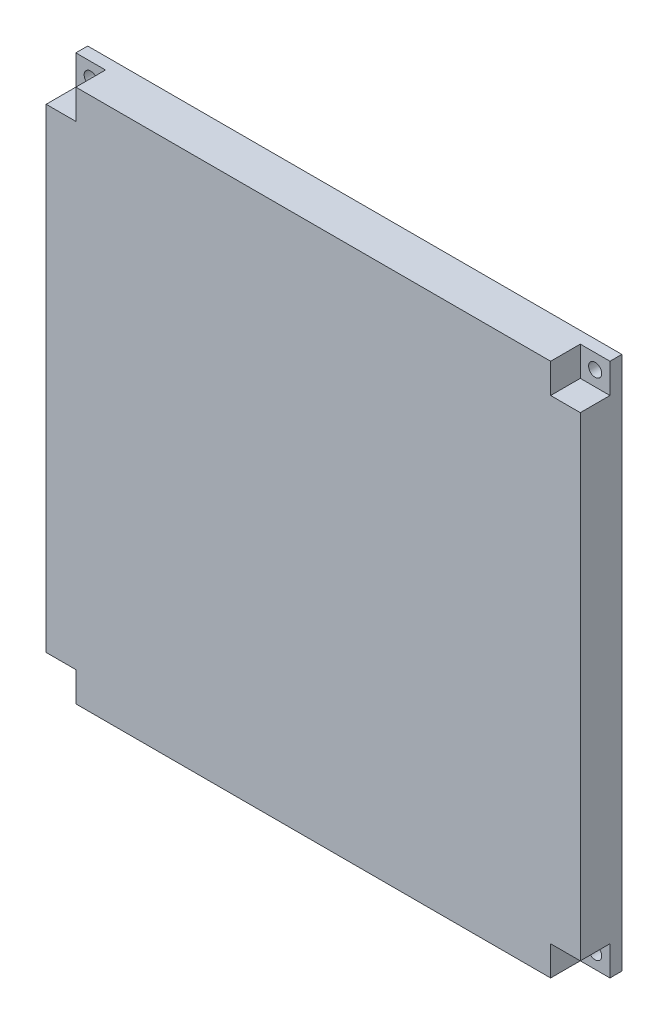
ISO-10303-21;
HEADER;
FILE_DESCRIPTION(('STEP AP214'),'2;1');
FILE_NAME('part.step','',(''),(''),'','','');
FILE_SCHEMA(('AUTOMOTIVE_DESIGN { 1 0 10303 214 1 1 1 1 }'));
ENDSEC;
DATA;
#1=APPLICATION_CONTEXT('core data for automotive mechanical design processes');
#2=APPLICATION_PROTOCOL_DEFINITION('international standard','automotive_design',2000,#1);
#3=PRODUCT_CONTEXT('',#1,'mechanical');
#4=PRODUCT('Part','Part','',(#3));
#5=PRODUCT_RELATED_PRODUCT_CATEGORY('part','',(#4));
#6=PRODUCT_DEFINITION_FORMATION('','',#4);
#7=PRODUCT_DEFINITION_CONTEXT('part definition',#1,'design');
#8=PRODUCT_DEFINITION('design','',#6,#7);
#9=PRODUCT_DEFINITION_SHAPE('','',#8);
#10=(LENGTH_UNIT() NAMED_UNIT(*) SI_UNIT(.MILLI.,.METRE.));
#11=(NAMED_UNIT(*) PLANE_ANGLE_UNIT() SI_UNIT($,.RADIAN.));
#12=(NAMED_UNIT(*) SI_UNIT($,.STERADIAN.) SOLID_ANGLE_UNIT());
#13=UNCERTAINTY_MEASURE_WITH_UNIT(LENGTH_MEASURE(1.E-05),#10,'distance_accuracy_value','');
#14=(GEOMETRIC_REPRESENTATION_CONTEXT(3) GLOBAL_UNCERTAINTY_ASSIGNED_CONTEXT((#13)) GLOBAL_UNIT_ASSIGNED_CONTEXT((#10,
#11,#12)) REPRESENTATION_CONTEXT('',''));
#15=CARTESIAN_POINT('',(0.,0.,0.));
#16=DIRECTION('',(0.,0.,1.));
#17=DIRECTION('',(1.,0.,0.));
#18=AXIS2_PLACEMENT_3D('',#15,#16,#17);
#19=CARTESIAN_POINT('',(-89.0867155495886,42.9813664596273,10.));
#20=DIRECTION('',(0.,1.,0.));
#21=DIRECTION('',(0.,0.,1.));
#22=AXIS2_PLACEMENT_3D('',#19,#20,#21);
#23=PLANE('',#22);
#24=DIRECTION('',(1.,0.,0.));
#25=VECTOR('',#24,1.);
#26=CARTESIAN_POINT('',(-84.0867155495887,42.9813664596273,3.));
#27=LINE('',#26,#25);
#28=CARTESIAN_POINT('',(-84.0867155495886,42.9813664596273,3.));
#29=VERTEX_POINT('',#28);
#30=CARTESIAN_POINT('',(5.91328445041136,42.9813664596273,3.));
#31=VERTEX_POINT('',#30);
#32=EDGE_CURVE('E178',#29,#31,#27,.T.);
#33=ORIENTED_EDGE('',*,*,#32,.F.);
#34=DIRECTION('',(0.,0.,-1.));
#35=VECTOR('',#34,1.);
#36=CARTESIAN_POINT('',(-84.0867155495886,42.9813664596273,3.));
#37=LINE('',#36,#35);
#38=CARTESIAN_POINT('',(-84.0867155495886,42.9813664596273,5.));
#39=VERTEX_POINT('',#38);
#40=EDGE_CURVE('E58',#39,#29,#37,.T.);
#41=ORIENTED_EDGE('',*,*,#40,.F.);
#42=DIRECTION('',(-1.,0.,0.));
#43=VECTOR('',#42,1.);
#44=CARTESIAN_POINT('',(-84.0867155495886,42.9813664596273,5.));
#45=LINE('',#44,#43);
#46=CARTESIAN_POINT('',(-79.0867155495886,42.9813664596273,5.));
#47=VERTEX_POINT('',#46);
#48=EDGE_CURVE('E298',#47,#39,#45,.T.);
#49=ORIENTED_EDGE('',*,*,#48,.F.);
#50=DIRECTION('',(0.,0.,1.));
#51=VECTOR('',#50,1.);
#52=CARTESIAN_POINT('',(-79.0867155495886,42.9813664596273,5.));
#53=LINE('',#52,#51);
#54=CARTESIAN_POINT('',(-79.0867155495886,42.9813664596273,10.));
#55=VERTEX_POINT('',#54);
#56=EDGE_CURVE('E308',#47,#55,#53,.T.);
#57=ORIENTED_EDGE('',*,*,#56,.T.);
#58=DIRECTION('',(1.,0.,0.));
#59=VECTOR('',#58,1.);
#60=CARTESIAN_POINT('',(-89.0867155495886,42.9813664596273,10.));
#61=LINE('',#60,#59);
#62=CARTESIAN_POINT('',(0.913284450411361,42.9813664596273,10.));
#63=VERTEX_POINT('',#62);
#64=EDGE_CURVE('E50',#55,#63,#61,.T.);
#65=ORIENTED_EDGE('',*,*,#64,.T.);
#66=DIRECTION('',(0.,0.,1.));
#67=VECTOR('',#66,1.);
#68=CARTESIAN_POINT('',(0.913284450411361,42.9813664596273,5.));
#69=LINE('',#68,#67);
#70=CARTESIAN_POINT('',(0.913284450411361,42.9813664596273,5.));
#71=VERTEX_POINT('',#70);
#72=EDGE_CURVE('E239',#71,#63,#69,.T.);
#73=ORIENTED_EDGE('',*,*,#72,.F.);
#74=DIRECTION('',(-1.,0.,0.));
#75=VECTOR('',#74,1.);
#76=CARTESIAN_POINT('',(5.91328445041135,42.9813664596273,5.));
#77=LINE('',#76,#75);
#78=CARTESIAN_POINT('',(5.91328445041136,42.9813664596273,5.));
#79=VERTEX_POINT('',#78);
#80=EDGE_CURVE('E226',#79,#71,#77,.T.);
#81=ORIENTED_EDGE('',*,*,#80,.F.);
#82=DIRECTION('',(0.,0.,1.));
#83=VECTOR('',#82,1.);
#84=CARTESIAN_POINT('',(5.91328445041136,42.9813664596273,3.));
#85=LINE('',#84,#83);
#86=EDGE_CURVE('E353',#31,#79,#85,.T.);
#87=ORIENTED_EDGE('',*,*,#86,.F.);
#88=EDGE_LOOP('',(#33,#41,#49,#57,#65,#73,#81,#87));
#89=FACE_BOUND('',#88,.T.);
#90=ADVANCED_FACE('F41',(#89),#23,.T.);
#91=CARTESIAN_POINT('',(-89.0867155495886,-47.0186335403727,10.));
#92=DIRECTION('',(0.,1.,0.));
#93=DIRECTION('',(0.,0.,1.));
#94=AXIS2_PLACEMENT_3D('',#91,#92,#93);
#95=PLANE('',#94);
#96=DIRECTION('',(0.,0.,1.));
#97=VECTOR('',#96,1.);
#98=CARTESIAN_POINT('',(-84.0867155495886,-47.0186335403727,3.00000000000001));
#99=LINE('',#98,#97);
#100=CARTESIAN_POINT('',(-84.0867155495886,-47.0186335403727,3.00000000000001));
#101=VERTEX_POINT('',#100);
#102=CARTESIAN_POINT('',(-84.0867155495886,-47.0186335403727,5.));
#103=VERTEX_POINT('',#102);
#104=EDGE_CURVE('E157',#101,#103,#99,.T.);
#105=ORIENTED_EDGE('',*,*,#104,.F.);
#106=DIRECTION('',(-1.,0.,0.));
#107=VECTOR('',#106,1.);
#108=CARTESIAN_POINT('',(5.91328445041138,-47.0186335403727,3.));
#109=LINE('',#108,#107);
#110=CARTESIAN_POINT('',(5.91328445041136,-47.0186335403727,3.));
#111=VERTEX_POINT('',#110);
#112=EDGE_CURVE('E168',#111,#101,#109,.T.);
#113=ORIENTED_EDGE('',*,*,#112,.F.);
#114=DIRECTION('',(0.,0.,-1.));
#115=VECTOR('',#114,1.);
#116=CARTESIAN_POINT('',(5.91328445041137,-47.0186335403727,2.99999999999999));
#117=LINE('',#116,#115);
#118=CARTESIAN_POINT('',(5.91328445041137,-47.0186335403727,5.));
#119=VERTEX_POINT('',#118);
#120=EDGE_CURVE('E66',#119,#111,#117,.T.);
#121=ORIENTED_EDGE('',*,*,#120,.F.);
#122=DIRECTION('',(1.,0.,0.));
#123=VECTOR('',#122,1.);
#124=CARTESIAN_POINT('',(5.91328445041132,-47.0186335403727,5.));
#125=LINE('',#124,#123);
#126=CARTESIAN_POINT('',(0.913284450411334,-47.0186335403727,5.));
#127=VERTEX_POINT('',#126);
#128=EDGE_CURVE('E188',#127,#119,#125,.T.);
#129=ORIENTED_EDGE('',*,*,#128,.F.);
#130=DIRECTION('',(0.,0.,1.));
#131=VECTOR('',#130,1.);
#132=CARTESIAN_POINT('',(0.913284450411334,-47.0186335403727,5.));
#133=LINE('',#132,#131);
#134=CARTESIAN_POINT('',(0.913284450411334,-47.0186335403727,10.));
#135=VERTEX_POINT('',#134);
#136=EDGE_CURVE('E211',#127,#135,#133,.T.);
#137=ORIENTED_EDGE('',*,*,#136,.T.);
#138=DIRECTION('',(1.,0.,0.));
#139=VECTOR('',#138,1.);
#140=CARTESIAN_POINT('',(-89.0867155495886,-47.0186335403727,10.));
#141=LINE('',#140,#139);
#142=CARTESIAN_POINT('',(-79.0867155495886,-47.0186335403727,10.));
#143=VERTEX_POINT('',#142);
#144=EDGE_CURVE('E11',#143,#135,#141,.T.);
#145=ORIENTED_EDGE('',*,*,#144,.F.);
#146=DIRECTION('',(0.,0.,1.));
#147=VECTOR('',#146,1.);
#148=CARTESIAN_POINT('',(-79.0867155495886,-47.0186335403727,5.));
#149=LINE('',#148,#147);
#150=CARTESIAN_POINT('',(-79.0867155495886,-47.0186335403727,5.));
#151=VERTEX_POINT('',#150);
#152=EDGE_CURVE('E271',#151,#143,#149,.T.);
#153=ORIENTED_EDGE('',*,*,#152,.F.);
#154=DIRECTION('',(1.,0.,0.));
#155=VECTOR('',#154,1.);
#156=CARTESIAN_POINT('',(-84.0867155495886,-47.0186335403727,5.));
#157=LINE('',#156,#155);
#158=EDGE_CURVE('E171',#103,#151,#157,.T.);
#159=ORIENTED_EDGE('',*,*,#158,.F.);
#160=EDGE_LOOP('',(#105,#113,#121,#129,#137,#145,#153,#159));
#161=FACE_BOUND('',#160,.T.);
#162=ADVANCED_FACE('F167',(#161),#95,.F.);
#163=CARTESIAN_POINT('',(0.,0.,10.));
#164=DIRECTION('',(0.,0.,-1.));
#165=DIRECTION('',(-1.,0.,0.));
#166=AXIS2_PLACEMENT_3D('',#163,#164,#165);
#167=PLANE('',#166);
#168=DIRECTION('',(0.,1.,0.));
#169=VECTOR('',#168,1.);
#170=CARTESIAN_POINT('',(-84.0867155495886,42.9813664596273,10.));
#171=LINE('',#170,#169);
#172=CARTESIAN_POINT('',(-84.0867155495886,-42.0186335403727,10.));
#173=VERTEX_POINT('',#172);
#174=CARTESIAN_POINT('',(-84.0867155495886,37.9813664596273,10.));
#175=VERTEX_POINT('',#174);
#176=EDGE_CURVE('E173',#173,#175,#171,.T.);
#177=ORIENTED_EDGE('',*,*,#176,.F.);
#178=DIRECTION('',(-1.,0.,0.));
#179=VECTOR('',#178,1.);
#180=CARTESIAN_POINT('',(-84.0867155495886,-42.0186335403727,10.));
#181=LINE('',#180,#179);
#182=CARTESIAN_POINT('',(-79.0867155495886,-42.0186335403727,10.));
#183=VERTEX_POINT('',#182);
#184=EDGE_CURVE('E260',#183,#173,#181,.T.);
#185=ORIENTED_EDGE('',*,*,#184,.F.);
#186=DIRECTION('',(0.,1.,0.));
#187=VECTOR('',#186,1.);
#188=CARTESIAN_POINT('',(-79.0867155495886,-47.0186335403727,10.));
#189=LINE('',#188,#187);
#190=EDGE_CURVE('E215',#143,#183,#189,.T.);
#191=ORIENTED_EDGE('',*,*,#190,.F.);
#192=ORIENTED_EDGE('',*,*,#144,.T.);
#193=DIRECTION('',(0.,-1.,0.));
#194=VECTOR('',#193,1.);
#195=CARTESIAN_POINT('',(0.913284450411334,-47.0186335403727,10.));
#196=LINE('',#195,#194);
#197=CARTESIAN_POINT('',(0.913284450411334,-42.0186335403727,10.));
#198=VERTEX_POINT('',#197);
#199=EDGE_CURVE('E193',#198,#135,#196,.T.);
#200=ORIENTED_EDGE('',*,*,#199,.F.);
#201=DIRECTION('',(-1.,0.,0.));
#202=VECTOR('',#201,1.);
#203=CARTESIAN_POINT('',(5.91328445041132,-42.0186335403727,10.));
#204=LINE('',#203,#202);
#205=CARTESIAN_POINT('',(5.91328445041137,-42.0186335403726,10.));
#206=VERTEX_POINT('',#205);
#207=EDGE_CURVE('E183',#206,#198,#204,.T.);
#208=ORIENTED_EDGE('',*,*,#207,.F.);
#209=DIRECTION('',(0.,-1.,0.));
#210=VECTOR('',#209,1.);
#211=CARTESIAN_POINT('',(5.91328445041136,42.9813664596273,10.));
#212=LINE('',#211,#210);
#213=CARTESIAN_POINT('',(5.91328445041136,37.9813664596273,10.));
#214=VERTEX_POINT('',#213);
#215=EDGE_CURVE('E350',#214,#206,#212,.T.);
#216=ORIENTED_EDGE('',*,*,#215,.F.);
#217=DIRECTION('',(1.,0.,0.));
#218=VECTOR('',#217,1.);
#219=CARTESIAN_POINT('',(5.91328445041135,37.9813664596273,10.));
#220=LINE('',#219,#218);
#221=CARTESIAN_POINT('',(0.913284450411361,37.9813664596273,10.));
#222=VERTEX_POINT('',#221);
#223=EDGE_CURVE('E227',#222,#214,#220,.T.);
#224=ORIENTED_EDGE('',*,*,#223,.F.);
#225=DIRECTION('',(0.,-1.,0.));
#226=VECTOR('',#225,1.);
#227=CARTESIAN_POINT('',(0.913284450411361,42.9813664596273,10.));
#228=LINE('',#227,#226);
#229=EDGE_CURVE('E240',#63,#222,#228,.T.);
#230=ORIENTED_EDGE('',*,*,#229,.F.);
#231=ORIENTED_EDGE('',*,*,#64,.F.);
#232=DIRECTION('',(0.,1.,0.));
#233=VECTOR('',#232,1.);
#234=CARTESIAN_POINT('',(-79.0867155495886,42.9813664596273,10.));
#235=LINE('',#234,#233);
#236=CARTESIAN_POINT('',(-79.0867155495886,37.9813664596273,10.));
#237=VERTEX_POINT('',#236);
#238=EDGE_CURVE('E290',#237,#55,#235,.T.);
#239=ORIENTED_EDGE('',*,*,#238,.F.);
#240=DIRECTION('',(1.,0.,0.));
#241=VECTOR('',#240,1.);
#242=CARTESIAN_POINT('',(-84.0867155495886,37.9813664596273,10.));
#243=LINE('',#242,#241);
#244=EDGE_CURVE('E251',#175,#237,#243,.T.);
#245=ORIENTED_EDGE('',*,*,#244,.F.);
#246=EDGE_LOOP('',(#177,#185,#191,#192,#200,#208,#216,#224,#230,#231,#239,#245));
#247=FACE_BOUND('',#246,.T.);
#248=ADVANCED_FACE('F370',(#247),#167,.F.);
#249=CARTESIAN_POINT('',(0.,0.,3.));
#250=DIRECTION('',(0.,0.,1.));
#251=DIRECTION('',(1.,0.,0.));
#252=AXIS2_PLACEMENT_3D('',#249,#250,#251);
#253=PLANE('',#252);
#254=CARTESIAN_POINT('',(3.41328445041138,40.4813664596273,3.));
#255=DIRECTION('',(0.,0.,-1.));
#256=DIRECTION('',(-1.,0.,0.));
#257=AXIS2_PLACEMENT_3D('',#254,#255,#256);
#258=CIRCLE('',#257,1.1);
#259=CARTESIAN_POINT('',(2.31328445041138,40.4813664596273,3.));
#260=VERTEX_POINT('',#259);
#261=EDGE_CURVE('E44',#260,#260,#258,.T.);
#262=ORIENTED_EDGE('',*,*,#261,.F.);
#263=EDGE_LOOP('',(#262));
#264=FACE_BOUND('',#263,.T.);
#265=CARTESIAN_POINT('',(-81.5867155495887,40.4813664596273,3.));
#266=DIRECTION('',(0.,0.,1.));
#267=DIRECTION('',(1.,0.,0.));
#268=AXIS2_PLACEMENT_3D('',#265,#266,#267);
#269=CIRCLE('',#268,1.1);
#270=CARTESIAN_POINT('',(-80.4867155495887,40.4813664596273,3.));
#271=VERTEX_POINT('',#270);
#272=EDGE_CURVE('E330',#271,#271,#269,.T.);
#273=ORIENTED_EDGE('',*,*,#272,.T.);
#274=EDGE_LOOP('',(#273));
#275=FACE_BOUND('',#274,.T.);
#276=CARTESIAN_POINT('',(-81.5867155495886,-44.5186335403727,3.));
#277=DIRECTION('',(0.,0.,1.));
#278=DIRECTION('',(1.,0.,0.));
#279=AXIS2_PLACEMENT_3D('',#276,#277,#278);
#280=CIRCLE('',#279,1.10000000000001);
#281=CARTESIAN_POINT('',(-80.4867155495886,-44.5186335403727,3.));
#282=VERTEX_POINT('',#281);
#283=EDGE_CURVE('E326',#282,#282,#280,.T.);
#284=ORIENTED_EDGE('',*,*,#283,.T.);
#285=EDGE_LOOP('',(#284));
#286=FACE_BOUND('',#285,.T.);
#287=CARTESIAN_POINT('',(3.41328445041138,-44.5186335403727,3.));
#288=DIRECTION('',(0.,0.,1.));
#289=DIRECTION('',(1.,0.,0.));
#290=AXIS2_PLACEMENT_3D('',#287,#288,#289);
#291=CIRCLE('',#290,1.1);
#292=CARTESIAN_POINT('',(4.51328445041138,-44.5186335403727,3.));
#293=VERTEX_POINT('',#292);
#294=EDGE_CURVE('E321',#293,#293,#291,.T.);
#295=ORIENTED_EDGE('',*,*,#294,.T.);
#296=EDGE_LOOP('',(#295));
#297=FACE_BOUND('',#296,.T.);
#298=DIRECTION('',(0.,-1.,0.));
#299=VECTOR('',#298,1.);
#300=CARTESIAN_POINT('',(-84.0867155495886,42.9813664596273,3.));
#301=LINE('',#300,#299);
#302=EDGE_CURVE('E154',#29,#101,#301,.T.);
#303=ORIENTED_EDGE('',*,*,#302,.F.);
#304=ORIENTED_EDGE('',*,*,#32,.T.);
#305=DIRECTION('',(0.,1.,0.));
#306=VECTOR('',#305,1.);
#307=CARTESIAN_POINT('',(5.91328445041136,42.9813664596273,3.));
#308=LINE('',#307,#306);
#309=EDGE_CURVE('E176',#111,#31,#308,.T.);
#310=ORIENTED_EDGE('',*,*,#309,.F.);
#311=ORIENTED_EDGE('',*,*,#112,.T.);
#312=EDGE_LOOP('',(#303,#304,#310,#311));
#313=FACE_BOUND('',#312,.T.);
#314=ADVANCED_FACE('F175',(#264,#275,#286,#297,#313),#253,.F.);
#315=CARTESIAN_POINT('',(-79.0867155495886,42.9813664596273,5.));
#316=DIRECTION('',(1.,0.,0.));
#317=DIRECTION('',(0.,0.,-1.));
#318=AXIS2_PLACEMENT_3D('',#315,#316,#317);
#319=PLANE('',#318);
#320=ORIENTED_EDGE('',*,*,#238,.T.);
#321=ORIENTED_EDGE('',*,*,#56,.F.);
#322=DIRECTION('',(0.,1.,0.));
#323=VECTOR('',#322,1.);
#324=CARTESIAN_POINT('',(-79.0867155495886,42.9813664596273,5.));
#325=LINE('',#324,#323);
#326=CARTESIAN_POINT('',(-79.0867155495886,37.9813664596273,5.));
#327=VERTEX_POINT('',#326);
#328=EDGE_CURVE('E294',#327,#47,#325,.T.);
#329=ORIENTED_EDGE('',*,*,#328,.F.);
#330=DIRECTION('',(0.,0.,1.));
#331=VECTOR('',#330,1.);
#332=CARTESIAN_POINT('',(-79.0867155495886,37.9813664596273,5.));
#333=LINE('',#332,#331);
#334=EDGE_CURVE('E312',#327,#237,#333,.T.);
#335=ORIENTED_EDGE('',*,*,#334,.T.);
#336=EDGE_LOOP('',(#320,#321,#329,#335));
#337=FACE_BOUND('',#336,.T.);
#338=ADVANCED_FACE('F374',(#337),#319,.F.);
#339=CARTESIAN_POINT('',(-84.0867155495886,37.9813664596273,5.));
#340=DIRECTION('',(0.,-1.,0.));
#341=DIRECTION('',(0.,0.,-1.));
#342=AXIS2_PLACEMENT_3D('',#339,#340,#341);
#343=PLANE('',#342);
#344=ORIENTED_EDGE('',*,*,#244,.T.);
#345=ORIENTED_EDGE('',*,*,#334,.F.);
#346=DIRECTION('',(1.,0.,0.));
#347=VECTOR('',#346,1.);
#348=CARTESIAN_POINT('',(-84.0867155495886,37.9813664596273,5.));
#349=LINE('',#348,#347);
#350=CARTESIAN_POINT('',(-84.0867155495886,37.9813664596273,5.));
#351=VERTEX_POINT('',#350);
#352=EDGE_CURVE('E289',#351,#327,#349,.T.);
#353=ORIENTED_EDGE('',*,*,#352,.F.);
#354=DIRECTION('',(0.,0.,1.));
#355=VECTOR('',#354,1.);
#356=CARTESIAN_POINT('',(-84.0867155495886,37.9813664596273,5.));
#357=LINE('',#356,#355);
#358=EDGE_CURVE('E302',#351,#175,#357,.T.);
#359=ORIENTED_EDGE('',*,*,#358,.T.);
#360=EDGE_LOOP('',(#344,#345,#353,#359));
#361=FACE_BOUND('',#360,.T.);
#362=ADVANCED_FACE('F368',(#361),#343,.F.);
#363=CARTESIAN_POINT('',(0.,0.,5.));
#364=DIRECTION('',(0.,0.,1.));
#365=DIRECTION('',(1.,0.,0.));
#366=AXIS2_PLACEMENT_3D('',#363,#364,#365);
#367=PLANE('',#366);
#368=CARTESIAN_POINT('',(-81.5867155495887,40.4813664596273,5.));
#369=DIRECTION('',(0.,0.,1.));
#370=DIRECTION('',(1.,0.,0.));
#371=AXIS2_PLACEMENT_3D('',#368,#369,#370);
#372=CIRCLE('',#371,1.1);
#373=CARTESIAN_POINT('',(-80.4867155495887,40.4813664596273,5.));
#374=VERTEX_POINT('',#373);
#375=EDGE_CURVE('E333',#374,#374,#372,.T.);
#376=ORIENTED_EDGE('',*,*,#375,.F.);
#377=EDGE_LOOP('',(#376));
#378=FACE_BOUND('',#377,.T.);
#379=DIRECTION('',(0.,-1.,0.));
#380=VECTOR('',#379,1.);
#381=CARTESIAN_POINT('',(-84.0867155495886,42.9813664596273,5.));
#382=LINE('',#381,#380);
#383=EDGE_CURVE('E285',#39,#351,#382,.T.);
#384=ORIENTED_EDGE('',*,*,#383,.T.);
#385=ORIENTED_EDGE('',*,*,#352,.T.);
#386=ORIENTED_EDGE('',*,*,#328,.T.);
#387=ORIENTED_EDGE('',*,*,#48,.T.);
#388=EDGE_LOOP('',(#384,#385,#386,#387));
#389=FACE_BOUND('',#388,.T.);
#390=ADVANCED_FACE('F380',(#378,#389),#367,.T.);
#391=CARTESIAN_POINT('',(0.913284450411334,-47.0186335403727,5.));
#392=DIRECTION('',(-1.,0.,0.));
#393=DIRECTION('',(0.,0.,1.));
#394=AXIS2_PLACEMENT_3D('',#391,#392,#393);
#395=PLANE('',#394);
#396=ORIENTED_EDGE('',*,*,#199,.T.);
#397=ORIENTED_EDGE('',*,*,#136,.F.);
#398=DIRECTION('',(0.,-1.,0.));
#399=VECTOR('',#398,1.);
#400=CARTESIAN_POINT('',(0.913284450411334,-47.0186335403727,5.));
#401=LINE('',#400,#399);
#402=CARTESIAN_POINT('',(0.913284450411334,-42.0186335403727,5.));
#403=VERTEX_POINT('',#402);
#404=EDGE_CURVE('E201',#403,#127,#401,.T.);
#405=ORIENTED_EDGE('',*,*,#404,.F.);
#406=DIRECTION('',(0.,0.,1.));
#407=VECTOR('',#406,1.);
#408=CARTESIAN_POINT('',(0.913284450411334,-42.0186335403727,5.));
#409=LINE('',#408,#407);
#410=EDGE_CURVE('E216',#403,#198,#409,.T.);
#411=ORIENTED_EDGE('',*,*,#410,.T.);
#412=EDGE_LOOP('',(#396,#397,#405,#411));
#413=FACE_BOUND('',#412,.T.);
#414=ADVANCED_FACE('F382',(#413),#395,.F.);
#415=CARTESIAN_POINT('',(5.91328445041132,-42.0186335403727,5.));
#416=DIRECTION('',(0.,1.,0.));
#417=DIRECTION('',(-1.,0.,0.));
#418=AXIS2_PLACEMENT_3D('',#415,#416,#417);
#419=PLANE('',#418);
#420=ORIENTED_EDGE('',*,*,#207,.T.);
#421=ORIENTED_EDGE('',*,*,#410,.F.);
#422=DIRECTION('',(-1.,0.,0.));
#423=VECTOR('',#422,1.);
#424=CARTESIAN_POINT('',(5.91328445041132,-42.0186335403727,5.));
#425=LINE('',#424,#423);
#426=CARTESIAN_POINT('',(5.91328445041137,-42.0186335403727,5.));
#427=VERTEX_POINT('',#426);
#428=EDGE_CURVE('E197',#427,#403,#425,.T.);
#429=ORIENTED_EDGE('',*,*,#428,.F.);
#430=DIRECTION('',(0.,0.,1.));
#431=VECTOR('',#430,1.);
#432=CARTESIAN_POINT('',(5.91328445041132,-42.0186335403727,5.));
#433=LINE('',#432,#431);
#434=EDGE_CURVE('E205',#427,#206,#433,.T.);
#435=ORIENTED_EDGE('',*,*,#434,.T.);
#436=EDGE_LOOP('',(#420,#421,#429,#435));
#437=FACE_BOUND('',#436,.T.);
#438=ADVANCED_FACE('F389',(#437),#419,.F.);
#439=CARTESIAN_POINT('',(0.,0.,5.));
#440=DIRECTION('',(0.,0.,-1.));
#441=DIRECTION('',(-1.,0.,0.));
#442=AXIS2_PLACEMENT_3D('',#439,#440,#441);
#443=PLANE('',#442);
#444=CARTESIAN_POINT('',(3.41328445041138,-44.5186335403727,5.));
#445=DIRECTION('',(0.,0.,-1.));
#446=DIRECTION('',(-1.,0.,0.));
#447=AXIS2_PLACEMENT_3D('',#444,#445,#446);
#448=CIRCLE('',#447,1.1);
#449=CARTESIAN_POINT('',(2.31328445041137,-44.5186335403727,5.));
#450=VERTEX_POINT('',#449);
#451=EDGE_CURVE('E325',#450,#450,#448,.T.);
#452=ORIENTED_EDGE('',*,*,#451,.T.);
#453=EDGE_LOOP('',(#452));
#454=FACE_BOUND('',#453,.T.);
#455=ORIENTED_EDGE('',*,*,#128,.T.);
#456=DIRECTION('',(0.,1.,0.));
#457=VECTOR('',#456,1.);
#458=CARTESIAN_POINT('',(5.91328445041132,-47.0186335403727,5.));
#459=LINE('',#458,#457);
#460=EDGE_CURVE('E192',#119,#427,#459,.T.);
#461=ORIENTED_EDGE('',*,*,#460,.T.);
#462=ORIENTED_EDGE('',*,*,#428,.T.);
#463=ORIENTED_EDGE('',*,*,#404,.T.);
#464=EDGE_LOOP('',(#455,#461,#462,#463));
#465=FACE_BOUND('',#464,.T.);
#466=ADVANCED_FACE('F417',(#454,#465),#443,.F.);
#467=CARTESIAN_POINT('',(-84.0867155495886,-42.0186335403727,5.));
#468=DIRECTION('',(0.,1.,0.));
#469=DIRECTION('',(-1.,0.,0.));
#470=AXIS2_PLACEMENT_3D('',#467,#468,#469);
#471=PLANE('',#470);
#472=ORIENTED_EDGE('',*,*,#184,.T.);
#473=DIRECTION('',(0.,0.,1.));
#474=VECTOR('',#473,1.);
#475=CARTESIAN_POINT('',(-84.0867155495886,-42.0186335403727,5.));
#476=LINE('',#475,#474);
#477=CARTESIAN_POINT('',(-84.0867155495886,-42.0186335403727,5.));
#478=VERTEX_POINT('',#477);
#479=EDGE_CURVE('E244',#478,#173,#476,.T.);
#480=ORIENTED_EDGE('',*,*,#479,.F.);
#481=DIRECTION('',(-1.,0.,0.));
#482=VECTOR('',#481,1.);
#483=CARTESIAN_POINT('',(-84.0867155495886,-42.0186335403727,5.));
#484=LINE('',#483,#482);
#485=CARTESIAN_POINT('',(-79.0867155495886,-42.0186335403727,5.));
#486=VERTEX_POINT('',#485);
#487=EDGE_CURVE('E267',#486,#478,#484,.T.);
#488=ORIENTED_EDGE('',*,*,#487,.F.);
#489=DIRECTION('',(0.,0.,1.));
#490=VECTOR('',#489,1.);
#491=CARTESIAN_POINT('',(-79.0867155495886,-42.0186335403727,5.));
#492=LINE('',#491,#490);
#493=EDGE_CURVE('E280',#486,#183,#492,.T.);
#494=ORIENTED_EDGE('',*,*,#493,.T.);
#495=EDGE_LOOP('',(#472,#480,#488,#494));
#496=FACE_BOUND('',#495,.T.);
#497=ADVANCED_FACE('F419',(#496),#471,.F.);
#498=CARTESIAN_POINT('',(-79.0867155495886,-47.0186335403727,5.));
#499=DIRECTION('',(1.,0.,0.));
#500=DIRECTION('',(0.,0.,-1.));
#501=AXIS2_PLACEMENT_3D('',#498,#499,#500);
#502=PLANE('',#501);
#503=ORIENTED_EDGE('',*,*,#190,.T.);
#504=ORIENTED_EDGE('',*,*,#493,.F.);
#505=DIRECTION('',(0.,1.,0.));
#506=VECTOR('',#505,1.);
#507=CARTESIAN_POINT('',(-79.0867155495886,-47.0186335403727,5.));
#508=LINE('',#507,#506);
#509=EDGE_CURVE('E263',#151,#486,#508,.T.);
#510=ORIENTED_EDGE('',*,*,#509,.F.);
#511=ORIENTED_EDGE('',*,*,#152,.T.);
#512=EDGE_LOOP('',(#503,#504,#510,#511));
#513=FACE_BOUND('',#512,.T.);
#514=ADVANCED_FACE('F441',(#513),#502,.F.);
#515=CARTESIAN_POINT('',(0.,0.,5.));
#516=DIRECTION('',(0.,0.,-1.));
#517=DIRECTION('',(-1.,0.,0.));
#518=AXIS2_PLACEMENT_3D('',#515,#516,#517);
#519=PLANE('',#518);
#520=CARTESIAN_POINT('',(-81.5867155495886,-44.5186335403727,5.));
#521=DIRECTION('',(0.,0.,-1.));
#522=DIRECTION('',(-1.,0.,0.));
#523=AXIS2_PLACEMENT_3D('',#520,#521,#522);
#524=CIRCLE('',#523,1.10000000000001);
#525=CARTESIAN_POINT('',(-82.6867155495886,-44.5186335403727,5.));
#526=VERTEX_POINT('',#525);
#527=EDGE_CURVE('E329',#526,#526,#524,.T.);
#528=ORIENTED_EDGE('',*,*,#527,.T.);
#529=EDGE_LOOP('',(#528));
#530=FACE_BOUND('',#529,.T.);
#531=DIRECTION('',(0.,-1.,0.));
#532=VECTOR('',#531,1.);
#533=CARTESIAN_POINT('',(-84.0867155495886,-47.0186335403727,5.));
#534=LINE('',#533,#532);
#535=EDGE_CURVE('E257',#478,#103,#534,.T.);
#536=ORIENTED_EDGE('',*,*,#535,.T.);
#537=ORIENTED_EDGE('',*,*,#158,.T.);
#538=ORIENTED_EDGE('',*,*,#509,.T.);
#539=ORIENTED_EDGE('',*,*,#487,.T.);
#540=EDGE_LOOP('',(#536,#537,#538,#539));
#541=FACE_BOUND('',#540,.T.);
#542=ADVANCED_FACE('F434',(#530,#541),#519,.F.);
#543=CARTESIAN_POINT('',(5.91328445041135,37.9813664596273,5.));
#544=DIRECTION('',(0.,-1.,0.));
#545=DIRECTION('',(1.,0.,0.));
#546=AXIS2_PLACEMENT_3D('',#543,#544,#545);
#547=PLANE('',#546);
#548=ORIENTED_EDGE('',*,*,#223,.T.);
#549=DIRECTION('',(0.,0.,1.));
#550=VECTOR('',#549,1.);
#551=CARTESIAN_POINT('',(5.91328445041135,37.9813664596273,5.));
#552=LINE('',#551,#550);
#553=CARTESIAN_POINT('',(5.91328445041136,37.9813664596273,5.));
#554=VERTEX_POINT('',#553);
#555=EDGE_CURVE('E248',#554,#214,#552,.T.);
#556=ORIENTED_EDGE('',*,*,#555,.F.);
#557=DIRECTION('',(1.,0.,0.));
#558=VECTOR('',#557,1.);
#559=CARTESIAN_POINT('',(5.91328445041135,37.9813664596273,5.));
#560=LINE('',#559,#558);
#561=CARTESIAN_POINT('',(0.913284450411361,37.9813664596273,5.));
#562=VERTEX_POINT('',#561);
#563=EDGE_CURVE('E235',#562,#554,#560,.T.);
#564=ORIENTED_EDGE('',*,*,#563,.F.);
#565=DIRECTION('',(0.,0.,1.));
#566=VECTOR('',#565,1.);
#567=CARTESIAN_POINT('',(0.913284450411361,37.9813664596273,5.));
#568=LINE('',#567,#566);
#569=EDGE_CURVE('E252',#562,#222,#568,.T.);
#570=ORIENTED_EDGE('',*,*,#569,.T.);
#571=EDGE_LOOP('',(#548,#556,#564,#570));
#572=FACE_BOUND('',#571,.T.);
#573=ADVANCED_FACE('F431',(#572),#547,.F.);
#574=CARTESIAN_POINT('',(0.913284450411361,42.9813664596273,5.));
#575=DIRECTION('',(-1.,0.,0.));
#576=DIRECTION('',(0.,0.,1.));
#577=AXIS2_PLACEMENT_3D('',#574,#575,#576);
#578=PLANE('',#577);
#579=ORIENTED_EDGE('',*,*,#229,.T.);
#580=ORIENTED_EDGE('',*,*,#569,.F.);
#581=DIRECTION('',(0.,-1.,0.));
#582=VECTOR('',#581,1.);
#583=CARTESIAN_POINT('',(0.913284450411361,42.9813664596273,5.));
#584=LINE('',#583,#582);
#585=EDGE_CURVE('E231',#71,#562,#584,.T.);
#586=ORIENTED_EDGE('',*,*,#585,.F.);
#587=ORIENTED_EDGE('',*,*,#72,.T.);
#588=EDGE_LOOP('',(#579,#580,#586,#587));
#589=FACE_BOUND('',#588,.T.);
#590=ADVANCED_FACE('F429',(#589),#578,.F.);
#591=CARTESIAN_POINT('',(0.,0.,5.));
#592=DIRECTION('',(0.,0.,-1.));
#593=DIRECTION('',(-1.,0.,0.));
#594=AXIS2_PLACEMENT_3D('',#591,#592,#593);
#595=PLANE('',#594);
#596=CARTESIAN_POINT('',(3.41328445041138,40.4813664596273,5.));
#597=DIRECTION('',(0.,0.,-1.));
#598=DIRECTION('',(-1.,0.,0.));
#599=AXIS2_PLACEMENT_3D('',#596,#597,#598);
#600=CIRCLE('',#599,1.1);
#601=CARTESIAN_POINT('',(2.31328445041138,40.4813664596273,5.));
#602=VERTEX_POINT('',#601);
#603=EDGE_CURVE('E179',#602,#602,#600,.T.);
#604=ORIENTED_EDGE('',*,*,#603,.T.);
#605=EDGE_LOOP('',(#604));
#606=FACE_BOUND('',#605,.T.);
#607=DIRECTION('',(0.,1.,0.));
#608=VECTOR('',#607,1.);
#609=CARTESIAN_POINT('',(5.91328445041135,42.9813664596273,5.));
#610=LINE('',#609,#608);
#611=EDGE_CURVE('E222',#554,#79,#610,.T.);
#612=ORIENTED_EDGE('',*,*,#611,.T.);
#613=ORIENTED_EDGE('',*,*,#80,.T.);
#614=ORIENTED_EDGE('',*,*,#585,.T.);
#615=ORIENTED_EDGE('',*,*,#563,.T.);
#616=EDGE_LOOP('',(#612,#613,#614,#615));
#617=FACE_BOUND('',#616,.T.);
#618=ADVANCED_FACE('F425',(#606,#617),#595,.F.);
#619=CARTESIAN_POINT('',(3.41328445041138,-44.5186335403727,42.));
#620=DIRECTION('',(0.,0.,-1.));
#621=DIRECTION('',(-1.,0.,0.));
#622=AXIS2_PLACEMENT_3D('',#619,#620,#621);
#623=CYLINDRICAL_SURFACE('',#622,1.1);
#624=ORIENTED_EDGE('',*,*,#294,.F.);
#625=EDGE_LOOP('',(#624));
#626=FACE_BOUND('',#625,.T.);
#627=ORIENTED_EDGE('',*,*,#451,.F.);
#628=EDGE_LOOP('',(#627));
#629=FACE_BOUND('',#628,.T.);
#630=ADVANCED_FACE('F428',(#626,#629),#623,.F.);
#631=CARTESIAN_POINT('',(-81.5867155495886,-44.5186335403727,42.));
#632=DIRECTION('',(0.,0.,-1.));
#633=DIRECTION('',(-1.,0.,0.));
#634=AXIS2_PLACEMENT_3D('',#631,#632,#633);
#635=CYLINDRICAL_SURFACE('',#634,1.10000000000001);
#636=ORIENTED_EDGE('',*,*,#283,.F.);
#637=EDGE_LOOP('',(#636));
#638=FACE_BOUND('',#637,.T.);
#639=ORIENTED_EDGE('',*,*,#527,.F.);
#640=EDGE_LOOP('',(#639));
#641=FACE_BOUND('',#640,.T.);
#642=ADVANCED_FACE('F478',(#638,#641),#635,.F.);
#643=CARTESIAN_POINT('',(-81.5867155495887,40.4813664596273,42.));
#644=DIRECTION('',(0.,0.,-1.));
#645=DIRECTION('',(-1.,0.,0.));
#646=AXIS2_PLACEMENT_3D('',#643,#644,#645);
#647=CYLINDRICAL_SURFACE('',#646,1.1);
#648=ORIENTED_EDGE('',*,*,#375,.T.);
#649=EDGE_LOOP('',(#648));
#650=FACE_BOUND('',#649,.T.);
#651=ORIENTED_EDGE('',*,*,#272,.F.);
#652=EDGE_LOOP('',(#651));
#653=FACE_BOUND('',#652,.T.);
#654=ADVANCED_FACE('F473',(#650,#653),#647,.F.);
#655=CARTESIAN_POINT('',(3.41328445041138,40.4813664596273,42.));
#656=DIRECTION('',(0.,0.,-1.));
#657=DIRECTION('',(-1.,0.,0.));
#658=AXIS2_PLACEMENT_3D('',#655,#656,#657);
#659=CYLINDRICAL_SURFACE('',#658,1.1);
#660=ORIENTED_EDGE('',*,*,#261,.T.);
#661=EDGE_LOOP('',(#660));
#662=FACE_BOUND('',#661,.T.);
#663=ORIENTED_EDGE('',*,*,#603,.F.);
#664=EDGE_LOOP('',(#663));
#665=FACE_BOUND('',#664,.T.);
#666=ADVANCED_FACE('F415',(#662,#665),#659,.F.);
#667=CARTESIAN_POINT('',(5.91328445041136,0.,0.));
#668=DIRECTION('',(-1.,0.,0.));
#669=DIRECTION('',(0.,-1.,0.));
#670=AXIS2_PLACEMENT_3D('',#667,#668,#669);
#671=PLANE('',#670);
#672=ORIENTED_EDGE('',*,*,#460,.F.);
#673=ORIENTED_EDGE('',*,*,#120,.T.);
#674=ORIENTED_EDGE('',*,*,#309,.T.);
#675=ORIENTED_EDGE('',*,*,#86,.T.);
#676=ORIENTED_EDGE('',*,*,#611,.F.);
#677=ORIENTED_EDGE('',*,*,#555,.T.);
#678=ORIENTED_EDGE('',*,*,#215,.T.);
#679=ORIENTED_EDGE('',*,*,#434,.F.);
#680=EDGE_LOOP('',(#672,#673,#674,#675,#676,#677,#678,#679));
#681=FACE_BOUND('',#680,.T.);
#682=ADVANCED_FACE('F458',(#681),#671,.F.);
#683=CARTESIAN_POINT('',(-84.0867155495886,0.,0.));
#684=DIRECTION('',(-1.,0.,0.));
#685=DIRECTION('',(0.,-1.,0.));
#686=AXIS2_PLACEMENT_3D('',#683,#684,#685);
#687=PLANE('',#686);
#688=ORIENTED_EDGE('',*,*,#358,.F.);
#689=ORIENTED_EDGE('',*,*,#383,.F.);
#690=ORIENTED_EDGE('',*,*,#40,.T.);
#691=ORIENTED_EDGE('',*,*,#302,.T.);
#692=ORIENTED_EDGE('',*,*,#104,.T.);
#693=ORIENTED_EDGE('',*,*,#535,.F.);
#694=ORIENTED_EDGE('',*,*,#479,.T.);
#695=ORIENTED_EDGE('',*,*,#176,.T.);
#696=EDGE_LOOP('',(#688,#689,#690,#691,#692,#693,#694,#695));
#697=FACE_BOUND('',#696,.T.);
#698=ADVANCED_FACE('F156',(#697),#687,.T.);
#699=CLOSED_SHELL('',(#90,#162,#248,#314,#338,#362,#390,#414,#438,#466,#497,#514,#542,#573,#590,
#618,#630,#642,#654,#666,#682,#698));
#700=MANIFOLD_SOLID_BREP('B2',#699);
#701=ADVANCED_BREP_SHAPE_REPRESENTATION('',(#18,#700),#14);
#702=SHAPE_DEFINITION_REPRESENTATION(#9,#701);
ENDSEC;
END-ISO-10303-21;
